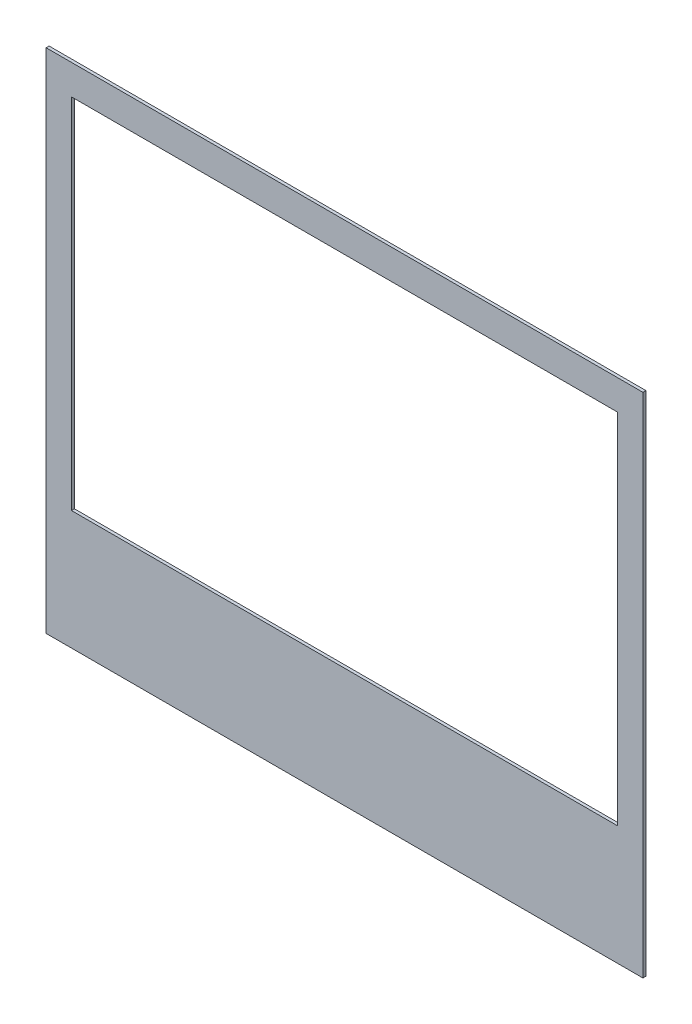
ISO-10303-21;
HEADER;
FILE_DESCRIPTION(('STEP AP214'),'2;1');
FILE_NAME('part.step','',(''),(''),'','','');
FILE_SCHEMA(('AUTOMOTIVE_DESIGN { 1 0 10303 214 1 1 1 1 }'));
ENDSEC;
DATA;
#1=APPLICATION_CONTEXT('core data for automotive mechanical design processes');
#2=APPLICATION_PROTOCOL_DEFINITION('international standard','automotive_design',2000,#1);
#3=PRODUCT_CONTEXT('',#1,'mechanical');
#4=PRODUCT('Part','Part','',(#3));
#5=PRODUCT_RELATED_PRODUCT_CATEGORY('part','',(#4));
#6=PRODUCT_DEFINITION_FORMATION('','',#4);
#7=PRODUCT_DEFINITION_CONTEXT('part definition',#1,'design');
#8=PRODUCT_DEFINITION('design','',#6,#7);
#9=PRODUCT_DEFINITION_SHAPE('','',#8);
#10=(LENGTH_UNIT() NAMED_UNIT(*) SI_UNIT(.MILLI.,.METRE.));
#11=(NAMED_UNIT(*) PLANE_ANGLE_UNIT() SI_UNIT($,.RADIAN.));
#12=(NAMED_UNIT(*) SI_UNIT($,.STERADIAN.) SOLID_ANGLE_UNIT());
#13=UNCERTAINTY_MEASURE_WITH_UNIT(LENGTH_MEASURE(1.E-05),#10,'distance_accuracy_value','');
#14=(GEOMETRIC_REPRESENTATION_CONTEXT(3) GLOBAL_UNCERTAINTY_ASSIGNED_CONTEXT((#13)) GLOBAL_UNIT_ASSIGNED_CONTEXT((#10,
#11,#12)) REPRESENTATION_CONTEXT('',''));
#15=CARTESIAN_POINT('',(0.,0.,0.));
#16=DIRECTION('',(0.,0.,1.));
#17=DIRECTION('',(1.,0.,0.));
#18=AXIS2_PLACEMENT_3D('',#15,#16,#17);
#19=CARTESIAN_POINT('',(0.,0.,0.2));
#20=DIRECTION('',(0.,0.,-1.));
#21=DIRECTION('',(-1.,0.,0.));
#22=AXIS2_PLACEMENT_3D('',#19,#20,#21);
#23=PLANE('',#22);
#24=DIRECTION('',(0.,-1.,0.));
#25=VECTOR('',#24,1.);
#26=CARTESIAN_POINT('',(0.,0.,0.2));
#27=LINE('',#26,#25);
#28=CARTESIAN_POINT('',(0.,33.98,0.2));
#29=VERTEX_POINT('',#28);
#30=CARTESIAN_POINT('',(0.,0.,0.2));
#31=VERTEX_POINT('',#30);
#32=EDGE_CURVE('E135',#29,#31,#27,.T.);
#33=ORIENTED_EDGE('',*,*,#32,.T.);
#34=DIRECTION('',(1.,0.,0.));
#35=VECTOR('',#34,1.);
#36=CARTESIAN_POINT('',(0.,0.,0.2));
#37=LINE('',#36,#35);
#38=CARTESIAN_POINT('',(39.98,0.,0.2));
#39=VERTEX_POINT('',#38);
#40=EDGE_CURVE('E138',#31,#39,#37,.T.);
#41=ORIENTED_EDGE('',*,*,#40,.T.);
#42=DIRECTION('',(0.,1.,0.));
#43=VECTOR('',#42,1.);
#44=CARTESIAN_POINT('',(39.98,0.,0.2));
#45=LINE('',#44,#43);
#46=CARTESIAN_POINT('',(39.98,33.98,0.2));
#47=VERTEX_POINT('',#46);
#48=EDGE_CURVE('E141',#39,#47,#45,.T.);
#49=ORIENTED_EDGE('',*,*,#48,.T.);
#50=DIRECTION('',(-1.,0.,0.));
#51=VECTOR('',#50,1.);
#52=CARTESIAN_POINT('',(0.,33.98,0.2));
#53=LINE('',#52,#51);
#54=EDGE_CURVE('E143',#47,#29,#53,.T.);
#55=ORIENTED_EDGE('',*,*,#54,.T.);
#56=EDGE_LOOP('',(#33,#41,#49,#55));
#57=FACE_BOUND('',#56,.T.);
#58=DIRECTION('',(0.,-1.,0.));
#59=VECTOR('',#58,1.);
#60=CARTESIAN_POINT('',(1.7,31.98,0.2));
#61=LINE('',#60,#59);
#62=CARTESIAN_POINT('',(1.7,31.98,0.2));
#63=VERTEX_POINT('',#62);
#64=CARTESIAN_POINT('',(1.7,7.97999999999999,0.2));
#65=VERTEX_POINT('',#64);
#66=EDGE_CURVE('E99',#63,#65,#61,.T.);
#67=ORIENTED_EDGE('',*,*,#66,.F.);
#68=DIRECTION('',(-1.,0.,0.));
#69=VECTOR('',#68,1.);
#70=CARTESIAN_POINT('',(1.7,31.98,0.2));
#71=LINE('',#70,#69);
#72=CARTESIAN_POINT('',(38.28,31.98,0.2));
#73=VERTEX_POINT('',#72);
#74=EDGE_CURVE('E121',#73,#63,#71,.T.);
#75=ORIENTED_EDGE('',*,*,#74,.F.);
#76=DIRECTION('',(0.,1.,0.));
#77=VECTOR('',#76,1.);
#78=CARTESIAN_POINT('',(38.28,31.98,0.2));
#79=LINE('',#78,#77);
#80=CARTESIAN_POINT('',(38.28,7.97999999999999,0.2));
#81=VERTEX_POINT('',#80);
#82=EDGE_CURVE('E119',#81,#73,#79,.T.);
#83=ORIENTED_EDGE('',*,*,#82,.F.);
#84=DIRECTION('',(1.,0.,0.));
#85=VECTOR('',#84,1.);
#86=CARTESIAN_POINT('',(1.7,7.97999999999999,0.2));
#87=LINE('',#86,#85);
#88=EDGE_CURVE('E107',#65,#81,#87,.T.);
#89=ORIENTED_EDGE('',*,*,#88,.F.);
#90=EDGE_LOOP('',(#67,#75,#83,#89));
#91=FACE_BOUND('',#90,.T.);
#92=ADVANCED_FACE('F34',(#57,#91),#23,.F.);
#93=CARTESIAN_POINT('',(0.,0.,0.));
#94=DIRECTION('',(0.,0.,-1.));
#95=DIRECTION('',(-1.,0.,0.));
#96=AXIS2_PLACEMENT_3D('',#93,#94,#95);
#97=PLANE('',#96);
#98=DIRECTION('',(0.,-1.,0.));
#99=VECTOR('',#98,1.);
#100=CARTESIAN_POINT('',(0.,0.,0.));
#101=LINE('',#100,#99);
#102=CARTESIAN_POINT('',(0.,33.98,0.));
#103=VERTEX_POINT('',#102);
#104=CARTESIAN_POINT('',(0.,0.,0.));
#105=VERTEX_POINT('',#104);
#106=EDGE_CURVE('E115',#103,#105,#101,.T.);
#107=ORIENTED_EDGE('',*,*,#106,.F.);
#108=DIRECTION('',(-1.,0.,0.));
#109=VECTOR('',#108,1.);
#110=CARTESIAN_POINT('',(0.,33.98,0.));
#111=LINE('',#110,#109);
#112=CARTESIAN_POINT('',(39.98,33.98,0.));
#113=VERTEX_POINT('',#112);
#114=EDGE_CURVE('E139',#113,#103,#111,.T.);
#115=ORIENTED_EDGE('',*,*,#114,.F.);
#116=DIRECTION('',(0.,1.,0.));
#117=VECTOR('',#116,1.);
#118=CARTESIAN_POINT('',(39.98,0.,0.));
#119=LINE('',#118,#117);
#120=CARTESIAN_POINT('',(39.98,0.,0.));
#121=VERTEX_POINT('',#120);
#122=EDGE_CURVE('E150',#121,#113,#119,.T.);
#123=ORIENTED_EDGE('',*,*,#122,.F.);
#124=DIRECTION('',(1.,0.,0.));
#125=VECTOR('',#124,1.);
#126=CARTESIAN_POINT('',(0.,0.,0.));
#127=LINE('',#126,#125);
#128=EDGE_CURVE('E148',#105,#121,#127,.T.);
#129=ORIENTED_EDGE('',*,*,#128,.F.);
#130=EDGE_LOOP('',(#107,#115,#123,#129));
#131=FACE_BOUND('',#130,.T.);
#132=DIRECTION('',(-1.,0.,0.));
#133=VECTOR('',#132,1.);
#134=CARTESIAN_POINT('',(1.7,31.98,0.));
#135=LINE('',#134,#133);
#136=CARTESIAN_POINT('',(38.28,31.98,0.));
#137=VERTEX_POINT('',#136);
#138=CARTESIAN_POINT('',(1.7,31.98,0.));
#139=VERTEX_POINT('',#138);
#140=EDGE_CURVE('E108',#137,#139,#135,.T.);
#141=ORIENTED_EDGE('',*,*,#140,.T.);
#142=DIRECTION('',(0.,-1.,0.));
#143=VECTOR('',#142,1.);
#144=CARTESIAN_POINT('',(1.7,31.98,0.));
#145=LINE('',#144,#143);
#146=CARTESIAN_POINT('',(1.7,7.97999999999999,0.));
#147=VERTEX_POINT('',#146);
#148=EDGE_CURVE('E57',#139,#147,#145,.T.);
#149=ORIENTED_EDGE('',*,*,#148,.T.);
#150=DIRECTION('',(1.,0.,0.));
#151=VECTOR('',#150,1.);
#152=CARTESIAN_POINT('',(1.7,7.97999999999999,0.));
#153=LINE('',#152,#151);
#154=CARTESIAN_POINT('',(38.28,7.97999999999999,0.));
#155=VERTEX_POINT('',#154);
#156=EDGE_CURVE('E114',#147,#155,#153,.T.);
#157=ORIENTED_EDGE('',*,*,#156,.T.);
#158=DIRECTION('',(0.,1.,0.));
#159=VECTOR('',#158,1.);
#160=CARTESIAN_POINT('',(38.28,31.98,0.));
#161=LINE('',#160,#159);
#162=EDGE_CURVE('E127',#155,#137,#161,.T.);
#163=ORIENTED_EDGE('',*,*,#162,.T.);
#164=EDGE_LOOP('',(#141,#149,#157,#163));
#165=FACE_BOUND('',#164,.T.);
#166=ADVANCED_FACE('F168',(#131,#165),#97,.T.);
#167=CARTESIAN_POINT('',(0.,0.,0.2));
#168=DIRECTION('',(1.,0.,0.));
#169=DIRECTION('',(0.,0.,-1.));
#170=AXIS2_PLACEMENT_3D('',#167,#168,#169);
#171=PLANE('',#170);
#172=ORIENTED_EDGE('',*,*,#106,.T.);
#173=DIRECTION('',(0.,0.,-1.));
#174=VECTOR('',#173,1.);
#175=CARTESIAN_POINT('',(0.,0.,0.2));
#176=LINE('',#175,#174);
#177=EDGE_CURVE('E11',#31,#105,#176,.T.);
#178=ORIENTED_EDGE('',*,*,#177,.F.);
#179=ORIENTED_EDGE('',*,*,#32,.F.);
#180=DIRECTION('',(0.,0.,-1.));
#181=VECTOR('',#180,1.);
#182=CARTESIAN_POINT('',(0.,33.98,0.2));
#183=LINE('',#182,#181);
#184=EDGE_CURVE('E145',#29,#103,#183,.T.);
#185=ORIENTED_EDGE('',*,*,#184,.T.);
#186=EDGE_LOOP('',(#172,#178,#179,#185));
#187=FACE_BOUND('',#186,.T.);
#188=ADVANCED_FACE('F36',(#187),#171,.F.);
#189=CARTESIAN_POINT('',(0.,0.,0.2));
#190=DIRECTION('',(0.,1.,0.));
#191=DIRECTION('',(0.,0.,1.));
#192=AXIS2_PLACEMENT_3D('',#189,#190,#191);
#193=PLANE('',#192);
#194=ORIENTED_EDGE('',*,*,#128,.T.);
#195=DIRECTION('',(0.,0.,-1.));
#196=VECTOR('',#195,1.);
#197=CARTESIAN_POINT('',(39.98,0.,0.2));
#198=LINE('',#197,#196);
#199=EDGE_CURVE('E42',#39,#121,#198,.T.);
#200=ORIENTED_EDGE('',*,*,#199,.F.);
#201=ORIENTED_EDGE('',*,*,#40,.F.);
#202=ORIENTED_EDGE('',*,*,#177,.T.);
#203=EDGE_LOOP('',(#194,#200,#201,#202));
#204=FACE_BOUND('',#203,.T.);
#205=ADVANCED_FACE('F178',(#204),#193,.F.);
#206=CARTESIAN_POINT('',(39.98,0.,0.2));
#207=DIRECTION('',(-1.,0.,0.));
#208=DIRECTION('',(0.,0.,1.));
#209=AXIS2_PLACEMENT_3D('',#206,#207,#208);
#210=PLANE('',#209);
#211=ORIENTED_EDGE('',*,*,#122,.T.);
#212=DIRECTION('',(0.,0.,-1.));
#213=VECTOR('',#212,1.);
#214=CARTESIAN_POINT('',(39.98,33.98,0.2));
#215=LINE('',#214,#213);
#216=EDGE_CURVE('E155',#47,#113,#215,.T.);
#217=ORIENTED_EDGE('',*,*,#216,.F.);
#218=ORIENTED_EDGE('',*,*,#48,.F.);
#219=ORIENTED_EDGE('',*,*,#199,.T.);
#220=EDGE_LOOP('',(#211,#217,#218,#219));
#221=FACE_BOUND('',#220,.T.);
#222=ADVANCED_FACE('F162',(#221),#210,.F.);
#223=CARTESIAN_POINT('',(0.,33.98,0.2));
#224=DIRECTION('',(0.,-1.,0.));
#225=DIRECTION('',(0.,0.,-1.));
#226=AXIS2_PLACEMENT_3D('',#223,#224,#225);
#227=PLANE('',#226);
#228=ORIENTED_EDGE('',*,*,#114,.T.);
#229=ORIENTED_EDGE('',*,*,#184,.F.);
#230=ORIENTED_EDGE('',*,*,#54,.F.);
#231=ORIENTED_EDGE('',*,*,#216,.T.);
#232=EDGE_LOOP('',(#228,#229,#230,#231));
#233=FACE_BOUND('',#232,.T.);
#234=ADVANCED_FACE('F172',(#233),#227,.F.);
#235=CARTESIAN_POINT('',(1.7,31.98,0.2));
#236=DIRECTION('',(1.,0.,0.));
#237=DIRECTION('',(0.,1.,0.));
#238=AXIS2_PLACEMENT_3D('',#235,#236,#237);
#239=PLANE('',#238);
#240=ORIENTED_EDGE('',*,*,#148,.F.);
#241=DIRECTION('',(0.,0.,-1.));
#242=VECTOR('',#241,1.);
#243=CARTESIAN_POINT('',(1.7,31.98,0.2));
#244=LINE('',#243,#242);
#245=EDGE_CURVE('E103',#63,#139,#244,.T.);
#246=ORIENTED_EDGE('',*,*,#245,.F.);
#247=ORIENTED_EDGE('',*,*,#66,.T.);
#248=DIRECTION('',(0.,0.,-1.));
#249=VECTOR('',#248,1.);
#250=CARTESIAN_POINT('',(1.7,7.97999999999999,0.2));
#251=LINE('',#250,#249);
#252=EDGE_CURVE('E102',#65,#147,#251,.T.);
#253=ORIENTED_EDGE('',*,*,#252,.T.);
#254=EDGE_LOOP('',(#240,#246,#247,#253));
#255=FACE_BOUND('',#254,.T.);
#256=ADVANCED_FACE('F101',(#255),#239,.T.);
#257=CARTESIAN_POINT('',(1.7,7.97999999999999,0.2));
#258=DIRECTION('',(0.,1.,0.));
#259=DIRECTION('',(0.,0.,1.));
#260=AXIS2_PLACEMENT_3D('',#257,#258,#259);
#261=PLANE('',#260);
#262=ORIENTED_EDGE('',*,*,#156,.F.);
#263=ORIENTED_EDGE('',*,*,#252,.F.);
#264=ORIENTED_EDGE('',*,*,#88,.T.);
#265=DIRECTION('',(0.,0.,-1.));
#266=VECTOR('',#265,1.);
#267=CARTESIAN_POINT('',(38.28,7.97999999999999,0.2));
#268=LINE('',#267,#266);
#269=EDGE_CURVE('E116',#81,#155,#268,.T.);
#270=ORIENTED_EDGE('',*,*,#269,.T.);
#271=EDGE_LOOP('',(#262,#263,#264,#270));
#272=FACE_BOUND('',#271,.T.);
#273=ADVANCED_FACE('F111',(#272),#261,.T.);
#274=CARTESIAN_POINT('',(38.28,31.98,0.2));
#275=DIRECTION('',(-1.,0.,0.));
#276=DIRECTION('',(0.,0.,1.));
#277=AXIS2_PLACEMENT_3D('',#274,#275,#276);
#278=PLANE('',#277);
#279=ORIENTED_EDGE('',*,*,#162,.F.);
#280=ORIENTED_EDGE('',*,*,#269,.F.);
#281=ORIENTED_EDGE('',*,*,#82,.T.);
#282=DIRECTION('',(0.,0.,-1.));
#283=VECTOR('',#282,1.);
#284=CARTESIAN_POINT('',(38.28,31.98,0.2));
#285=LINE('',#284,#283);
#286=EDGE_CURVE('E49',#73,#137,#285,.T.);
#287=ORIENTED_EDGE('',*,*,#286,.T.);
#288=EDGE_LOOP('',(#279,#280,#281,#287));
#289=FACE_BOUND('',#288,.T.);
#290=ADVANCED_FACE('F201',(#289),#278,.T.);
#291=CARTESIAN_POINT('',(1.7,31.98,0.2));
#292=DIRECTION('',(0.,-1.,0.));
#293=DIRECTION('',(0.,0.,-1.));
#294=AXIS2_PLACEMENT_3D('',#291,#292,#293);
#295=PLANE('',#294);
#296=ORIENTED_EDGE('',*,*,#140,.F.);
#297=ORIENTED_EDGE('',*,*,#286,.F.);
#298=ORIENTED_EDGE('',*,*,#74,.T.);
#299=ORIENTED_EDGE('',*,*,#245,.T.);
#300=EDGE_LOOP('',(#296,#297,#298,#299));
#301=FACE_BOUND('',#300,.T.);
#302=ADVANCED_FACE('F205',(#301),#295,.T.);
#303=CLOSED_SHELL('',(#92,#166,#188,#205,#222,#234,#256,#273,#290,#302));
#304=MANIFOLD_SOLID_BREP('B2',#303);
#305=ADVANCED_BREP_SHAPE_REPRESENTATION('',(#18,#304),#14);
#306=SHAPE_DEFINITION_REPRESENTATION(#9,#305);
ENDSEC;
END-ISO-10303-21;
